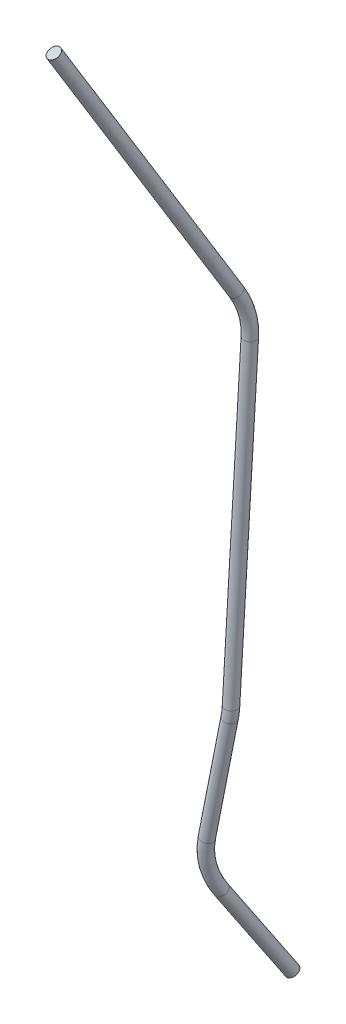
ISO-10303-21;
HEADER;
FILE_DESCRIPTION(('STEP AP214'),'2;1');
FILE_NAME('part.step','',(''),(''),'','','');
FILE_SCHEMA(('AUTOMOTIVE_DESIGN { 1 0 10303 214 1 1 1 1 }'));
ENDSEC;
DATA;
#1=APPLICATION_CONTEXT('core data for automotive mechanical design processes');
#2=APPLICATION_PROTOCOL_DEFINITION('international standard','automotive_design',2000,#1);
#3=PRODUCT_CONTEXT('',#1,'mechanical');
#4=PRODUCT('Part','Part','',(#3));
#5=PRODUCT_RELATED_PRODUCT_CATEGORY('part','',(#4));
#6=PRODUCT_DEFINITION_FORMATION('','',#4);
#7=PRODUCT_DEFINITION_CONTEXT('part definition',#1,'design');
#8=PRODUCT_DEFINITION('design','',#6,#7);
#9=PRODUCT_DEFINITION_SHAPE('','',#8);
#10=(LENGTH_UNIT() NAMED_UNIT(*) SI_UNIT(.MILLI.,.METRE.));
#11=(NAMED_UNIT(*) PLANE_ANGLE_UNIT() SI_UNIT($,.RADIAN.));
#12=(NAMED_UNIT(*) SI_UNIT($,.STERADIAN.) SOLID_ANGLE_UNIT());
#13=UNCERTAINTY_MEASURE_WITH_UNIT(LENGTH_MEASURE(1.E-05),#10,'distance_accuracy_value','');
#14=(GEOMETRIC_REPRESENTATION_CONTEXT(3) GLOBAL_UNCERTAINTY_ASSIGNED_CONTEXT((#13)) GLOBAL_UNIT_ASSIGNED_CONTEXT((#10,
#11,#12)) REPRESENTATION_CONTEXT('',''));
#15=CARTESIAN_POINT('',(0.,0.,0.));
#16=DIRECTION('',(0.,0.,1.));
#17=DIRECTION('',(1.,0.,0.));
#18=AXIS2_PLACEMENT_3D('',#15,#16,#17);
#19=CARTESIAN_POINT('',(1449.71533050925,595.995124963527,209.959342549605));
#20=DIRECTION('',(0.188625829596822,-0.868092206525634,-0.459169050980538));
#21=DIRECTION('',(0.,0.467562247068626,-0.883960149054321));
#22=AXIS2_PLACEMENT_3D('',#19,#20,#21);
#23=PLANE('',#22);
#24=CARTESIAN_POINT('',(1449.71533050925,595.995124963527,209.959342549605));
#25=DIRECTION('',(0.188625829596822,-0.868092206525634,-0.459169050980538));
#26=DIRECTION('',(0.,0.467562247068626,-0.883960149054321));
#27=AXIS2_PLACEMENT_3D('',#24,#25,#26);
#28=CIRCLE('',#27,3.00000000000011);
#29=CARTESIAN_POINT('',(1449.71533050925,597.397811704733,207.307462102442));
#30=VERTEX_POINT('',#29);
#31=EDGE_CURVE('E60',#30,#30,#28,.T.);
#32=ORIENTED_EDGE('',*,*,#31,.F.);
#33=EDGE_LOOP('',(#32));
#34=FACE_BOUND('',#33,.T.);
#35=ADVANCED_FACE('F32',(#34),#23,.F.);
#36=CARTESIAN_POINT('',(1466.53945330933,170.567619096099,111.362215138032));
#37=DIRECTION('',(0.210877865726897,-0.842182748669244,-0.496244640868176));
#38=DIRECTION('',(0.0277340880761741,0.512611073153342,-0.858172889363887));
#39=AXIS2_PLACEMENT_3D('',#36,#37,#38);
#40=PLANE('',#39);
#41=CARTESIAN_POINT('',(1466.53945330933,170.567619096099,111.362215138032));
#42=DIRECTION('',(0.210877865726897,-0.842182748669244,-0.496244640868176));
#43=DIRECTION('',(0.0277340880761741,0.512611073153342,-0.858172889363887));
#44=AXIS2_PLACEMENT_3D('',#41,#42,#43);
#45=CIRCLE('',#44,3.00000000000011);
#46=CARTESIAN_POINT('',(1466.62265557356,172.105452315559,108.78769646994));
#47=VERTEX_POINT('',#46);
#48=EDGE_CURVE('E10',#47,#47,#45,.T.);
#49=ORIENTED_EDGE('',*,*,#48,.T.);
#50=EDGE_LOOP('',(#49));
#51=FACE_BOUND('',#50,.T.);
#52=ADVANCED_FACE('F67',(#51),#40,.T.);
#53=CARTESIAN_POINT('',(1449.71533050925,595.995124963527,209.959342549605));
#54=DIRECTION('',(0.188625829596822,-0.868092206525634,-0.459169050980537));
#55=DIRECTION('',(0.,0.467562247068626,-0.883960149054321));
#56=AXIS2_PLACEMENT_3D('',#53,#54,#55);
#57=CYLINDRICAL_SURFACE('',#56,3.00000000000011);
#58=CARTESIAN_POINT('',(1475.41327273936,477.728271365695,147.403224062707));
#59=DIRECTION('',(0.188625829596822,-0.868092206525634,-0.459169050980538));
#60=DIRECTION('',(0.,0.467562247068626,-0.883960149054321));
#61=AXIS2_PLACEMENT_3D('',#58,#59,#60);
#62=CIRCLE('',#61,3.00000000000011);
#63=CARTESIAN_POINT('',(1476.68091098708,479.209703764642,145.123212808291));
#64=VERTEX_POINT('',#63);
#65=EDGE_CURVE('E57',#64,#64,#62,.T.);
#66=ORIENTED_EDGE('',*,*,#65,.F.);
#67=EDGE_LOOP('',(#66));
#68=FACE_BOUND('',#67,.T.);
#69=ORIENTED_EDGE('',*,*,#31,.T.);
#70=EDGE_LOOP('',(#69));
#71=FACE_BOUND('',#70,.T.);
#72=ADVANCED_FACE('F64',(#68,#71),#57,.T.);
#73=CARTESIAN_POINT('',(1458.51142943639,457.975839379737,177.803374121584));
#74=DIRECTION('',(-0.886495969821755,0.050663745612993,-0.459954432928141));
#75=DIRECTION('',(-0.460545880771322,0.,0.887635900414448));
#76=AXIS2_PLACEMENT_3D('',#73,#74,#75);
#77=TOROIDAL_SURFACE('',#76,40.0000000000009,3.00000000000011);
#78=CARTESIAN_POINT('',(1476.87963421091,456.92608609744,142.285673303434));
#79=DIRECTION('',(-0.0570574608670655,-0.998370896089927,0.));
#80=DIRECTION('',(0.0330921241135481,-0.00189123359265725,-0.999450516312414));
#81=AXIS2_PLACEMENT_3D('',#78,#79,#80);
#82=CIRCLE('',#81,3.00000000000011);
#83=CARTESIAN_POINT('',(1478.257249569,456.847354601268,139.621845742072));
#84=VERTEX_POINT('',#83);
#85=EDGE_CURVE('E54',#84,#84,#82,.T.);
#86=CARTESIAN_POINT('',(1458.51142943639,457.975839379737,177.803374121584));
#87=DIRECTION('',(-0.886495969821755,0.050663745612993,-0.459954432928141));
#88=DIRECTION('',(-0.460545880771322,0.,0.887635900414448));
#89=AXIS2_PLACEMENT_3D('',#86,#87,#88);
#90=CIRCLE('',#89,43.000000000001);
#91=EDGE_CURVE('',#64,#84,#90,.T.);
#92=ORIENTED_EDGE('',*,*,#65,.T.);
#93=ORIENTED_EDGE('',*,*,#85,.F.);
#94=ORIENTED_EDGE('',*,*,#91,.T.);
#95=ORIENTED_EDGE('',*,*,#91,.F.);
#96=EDGE_LOOP('',(#92,#94,#93,#95));
#97=FACE_BOUND('',#96,.T.);
#98=ADVANCED_FACE('F93',(#97),#77,.T.);
#99=CARTESIAN_POINT('',(1476.87963421091,456.92608609744,142.285673303434));
#100=DIRECTION('',(-0.0570574608670654,-0.998370896089927,0.));
#101=DIRECTION('',(0.998370896089927,-0.0570574608670654,0.));
#102=AXIS2_PLACEMENT_3D('',#99,#100,#101);
#103=CYLINDRICAL_SURFACE('',#102,3.00000000000011);
#104=CARTESIAN_POINT('',(1467.78007247316,297.705232801599,142.285673303434));
#105=DIRECTION('',(-0.0570574608670656,-0.998370896089927,0.));
#106=DIRECTION('',(0.0330921241135481,-0.00189123359265703,-0.999450516312415));
#107=AXIS2_PLACEMENT_3D('',#104,#105,#106);
#108=CIRCLE('',#107,3.00000000000011);
#109=CARTESIAN_POINT('',(1470.77518516143,297.534060418998,142.285673303434));
#110=VERTEX_POINT('',#109);
#111=EDGE_CURVE('E51',#110,#110,#108,.T.);
#112=ORIENTED_EDGE('',*,*,#111,.F.);
#113=EDGE_LOOP('',(#112));
#114=FACE_BOUND('',#113,.T.);
#115=ORIENTED_EDGE('',*,*,#85,.T.);
#116=EDGE_LOOP('',(#115));
#117=FACE_BOUND('',#116,.T.);
#118=ADVANCED_FACE('F89',(#114,#117),#103,.T.);
#119=CARTESIAN_POINT('',(1427.84523662956,299.987531236282,142.285673303434));
#120=DIRECTION('',(0.,0.,-1.));
#121=DIRECTION('',(-1.,0.,0.));
#122=AXIS2_PLACEMENT_3D('',#119,#120,#121);
#123=TOROIDAL_SURFACE('',#122,40.0000000000003,3.00000000000011);
#124=CARTESIAN_POINT('',(1467.0846517755,292.224265235124,142.285673303434));
#125=DIRECTION('',(-0.194081650028943,-0.98098537864845,0.));
#126=DIRECTION('',(0.032515861621117,-0.00643305416461309,-0.999450516312414));
#127=AXIS2_PLACEMENT_3D('',#124,#125,#126);
#128=CIRCLE('',#127,3.00000000000011);
#129=CARTESIAN_POINT('',(1470.02760791144,291.642020285037,142.285673303434));
#130=VERTEX_POINT('',#129);
#131=EDGE_CURVE('E46',#130,#130,#128,.T.);
#132=CARTESIAN_POINT('',(1427.84523662956,299.987531236282,142.285673303434));
#133=DIRECTION('',(0.,0.,-1.));
#134=DIRECTION('',(-1.,0.,0.));
#135=AXIS2_PLACEMENT_3D('',#132,#133,#134);
#136=CIRCLE('',#135,43.0000000000004);
#137=EDGE_CURVE('',#110,#130,#136,.T.);
#138=ORIENTED_EDGE('',*,*,#111,.T.);
#139=ORIENTED_EDGE('',*,*,#131,.F.);
#140=ORIENTED_EDGE('',*,*,#137,.T.);
#141=ORIENTED_EDGE('',*,*,#137,.F.);
#142=EDGE_LOOP('',(#138,#140,#139,#141));
#143=FACE_BOUND('',#142,.T.);
#144=ADVANCED_FACE('F85',(#143),#123,.T.);
#145=CARTESIAN_POINT('',(1467.0846517755,292.224265235124,142.285673303434));
#146=DIRECTION('',(-0.19408165002894,-0.980985378648451,0.));
#147=DIRECTION('',(0.980985378648451,-0.19408165002894,0.));
#148=AXIS2_PLACEMENT_3D('',#145,#146,#147);
#149=CYLINDRICAL_SURFACE('',#148,3.00000000000011);
#150=CARTESIAN_POINT('',(1456.09120663709,236.657914989515,142.285673303434));
#151=DIRECTION('',(-0.194081650028941,-0.980985378648451,0.));
#152=DIRECTION('',(0.032515861621117,-0.00643305416461298,-0.999450516312414));
#153=AXIS2_PLACEMENT_3D('',#150,#151,#152);
#154=CIRCLE('',#153,3.00000000000011);
#155=CARTESIAN_POINT('',(1454.3311055548,237.006139672272,144.689999352545));
#156=VERTEX_POINT('',#155);
#157=EDGE_CURVE('E42',#156,#156,#154,.T.);
#158=ORIENTED_EDGE('',*,*,#157,.F.);
#159=EDGE_LOOP('',(#158));
#160=FACE_BOUND('',#159,.T.);
#161=ORIENTED_EDGE('',*,*,#131,.T.);
#162=EDGE_LOOP('',(#161));
#163=FACE_BOUND('',#162,.T.);
#164=ADVANCED_FACE('F79',(#160,#163),#149,.T.);
#165=CARTESIAN_POINT('',(1479.55922106765,232.014919219424,110.227992648619));
#166=DIRECTION('',(0.786202899893873,-0.155545188939683,0.598072482560587));
#167=DIRECTION('',(0.605441444931915,0.,-0.795889852152139));
#168=AXIS2_PLACEMENT_3D('',#165,#166,#167);
#169=TOROIDAL_SURFACE('',#168,39.9999999999998,3.00000000000011);
#170=CARTESIAN_POINT('',(1456.32422932003,211.364150244236,135.401011919685));
#171=DIRECTION('',(0.210877865726896,-0.842182748669245,-0.496244640868175));
#172=DIRECTION('',(0.0277340880761742,0.512611073153341,-0.858172889363888));
#173=AXIS2_PLACEMENT_3D('',#170,#171,#172);
#174=CIRCLE('',#173,3.00000000000011);
#175=CARTESIAN_POINT('',(1454.58160493896,209.815342571097,137.288988365015));
#176=VERTEX_POINT('',#175);
#177=EDGE_CURVE('E38',#176,#176,#174,.T.);
#178=CARTESIAN_POINT('',(1479.55922106765,232.014919219424,110.227992648619));
#179=DIRECTION('',(0.786202899893873,-0.155545188939683,0.598072482560587));
#180=DIRECTION('',(0.605441444931915,0.,-0.795889852152139));
#181=AXIS2_PLACEMENT_3D('',#178,#179,#180);
#182=CIRCLE('',#181,42.9999999999999);
#183=EDGE_CURVE('',#156,#176,#182,.T.);
#184=ORIENTED_EDGE('',*,*,#157,.T.);
#185=ORIENTED_EDGE('',*,*,#177,.F.);
#186=ORIENTED_EDGE('',*,*,#183,.T.);
#187=ORIENTED_EDGE('',*,*,#183,.F.);
#188=EDGE_LOOP('',(#184,#186,#185,#187));
#189=FACE_BOUND('',#188,.T.);
#190=ADVANCED_FACE('F73',(#189),#169,.T.);
#191=CARTESIAN_POINT('',(1456.32422932003,211.364150244236,135.401011919685));
#192=DIRECTION('',(0.210877865726897,-0.842182748669244,-0.496244640868176));
#193=DIRECTION('',(0.,0.507660702969259,-0.861557084969277));
#194=AXIS2_PLACEMENT_3D('',#191,#192,#193);
#195=CYLINDRICAL_SURFACE('',#194,3.00000000000011);
#196=ORIENTED_EDGE('',*,*,#48,.F.);
#197=EDGE_LOOP('',(#196));
#198=FACE_BOUND('',#197,.T.);
#199=ORIENTED_EDGE('',*,*,#177,.T.);
#200=EDGE_LOOP('',(#199));
#201=FACE_BOUND('',#200,.T.);
#202=ADVANCED_FACE('F71',(#198,#201),#195,.T.);
#203=CLOSED_SHELL('',(#35,#52,#72,#98,#118,#144,#164,#190,#202));
#204=MANIFOLD_SOLID_BREP('B2',#203);
#205=ADVANCED_BREP_SHAPE_REPRESENTATION('',(#18,#204),#14);
#206=SHAPE_DEFINITION_REPRESENTATION(#9,#205);
ENDSEC;
END-ISO-10303-21;
